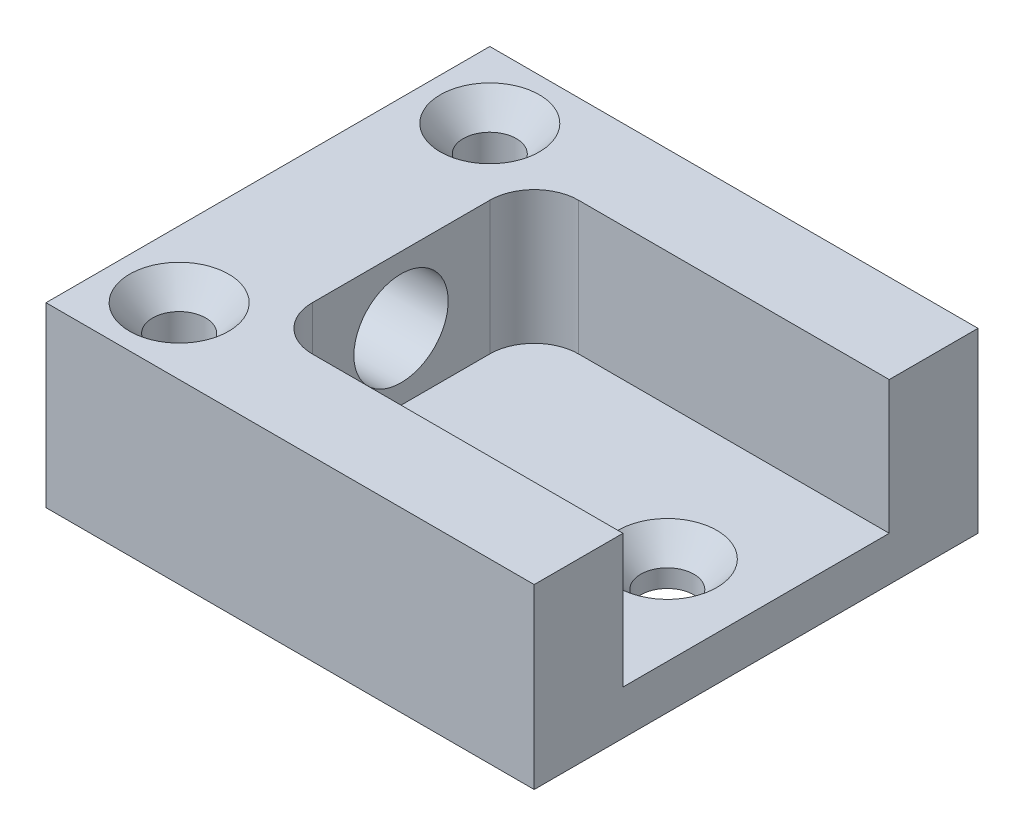
ISO-10303-21;
HEADER;
FILE_DESCRIPTION(('STEP AP214'),'2;1');
FILE_NAME('part.step','',(''),(''),'','','');
FILE_SCHEMA(('AUTOMOTIVE_DESIGN { 1 0 10303 214 1 1 1 1 }'));
ENDSEC;
DATA;
#1=APPLICATION_CONTEXT('core data for automotive mechanical design processes');
#2=APPLICATION_PROTOCOL_DEFINITION('international standard','automotive_design',2000,#1);
#3=PRODUCT_CONTEXT('',#1,'mechanical');
#4=PRODUCT('Part','Part','',(#3));
#5=PRODUCT_RELATED_PRODUCT_CATEGORY('part','',(#4));
#6=PRODUCT_DEFINITION_FORMATION('','',#4);
#7=PRODUCT_DEFINITION_CONTEXT('part definition',#1,'design');
#8=PRODUCT_DEFINITION('design','',#6,#7);
#9=PRODUCT_DEFINITION_SHAPE('','',#8);
#10=(LENGTH_UNIT() NAMED_UNIT(*) SI_UNIT(.MILLI.,.METRE.));
#11=(NAMED_UNIT(*) PLANE_ANGLE_UNIT() SI_UNIT($,.RADIAN.));
#12=(NAMED_UNIT(*) SI_UNIT($,.STERADIAN.) SOLID_ANGLE_UNIT());
#13=UNCERTAINTY_MEASURE_WITH_UNIT(LENGTH_MEASURE(1.E-05),#10,'distance_accuracy_value','');
#14=(GEOMETRIC_REPRESENTATION_CONTEXT(3) GLOBAL_UNCERTAINTY_ASSIGNED_CONTEXT((#13)) GLOBAL_UNIT_ASSIGNED_CONTEXT((#10,
#11,#12)) REPRESENTATION_CONTEXT('',''));
#15=CARTESIAN_POINT('',(0.,0.,0.));
#16=DIRECTION('',(0.,0.,1.));
#17=DIRECTION('',(1.,0.,0.));
#18=AXIS2_PLACEMENT_3D('',#15,#16,#17);
#19=CARTESIAN_POINT('',(34.925,12.7,9.525));
#20=DIRECTION('',(0.,0.,1.));
#21=DIRECTION('',(1.,0.,0.));
#22=AXIS2_PLACEMENT_3D('',#19,#20,#21);
#23=PLANE('',#22);
#24=DIRECTION('',(-1.,0.,0.));
#25=VECTOR('',#24,1.);
#26=CARTESIAN_POINT('',(9.525,3.175,9.525));
#27=LINE('',#26,#25);
#28=CARTESIAN_POINT('',(34.925,3.175,9.525));
#29=VERTEX_POINT('',#28);
#30=CARTESIAN_POINT('',(12.7,3.175,9.525));
#31=VERTEX_POINT('',#30);
#32=EDGE_CURVE('E192',#29,#31,#27,.T.);
#33=ORIENTED_EDGE('',*,*,#32,.T.);
#34=DIRECTION('',(0.,-1.,0.));
#35=VECTOR('',#34,1.);
#36=CARTESIAN_POINT('',(12.7,12.7,9.525));
#37=LINE('',#36,#35);
#38=CARTESIAN_POINT('',(12.7,12.7,9.525));
#39=VERTEX_POINT('',#38);
#40=EDGE_CURVE('E56',#31,#39,#37,.F.);
#41=ORIENTED_EDGE('',*,*,#40,.T.);
#42=DIRECTION('',(-1.,0.,0.));
#43=VECTOR('',#42,1.);
#44=CARTESIAN_POINT('',(34.925,12.7,9.525));
#45=LINE('',#44,#43);
#46=CARTESIAN_POINT('',(34.925,12.7,9.525));
#47=VERTEX_POINT('',#46);
#48=EDGE_CURVE('E197',#47,#39,#45,.T.);
#49=ORIENTED_EDGE('',*,*,#48,.F.);
#50=DIRECTION('',(0.,-1.,0.));
#51=VECTOR('',#50,1.);
#52=CARTESIAN_POINT('',(34.925,12.7,9.525));
#53=LINE('',#52,#51);
#54=EDGE_CURVE('E216',#47,#29,#53,.T.);
#55=ORIENTED_EDGE('',*,*,#54,.T.);
#56=EDGE_LOOP('',(#33,#41,#49,#55));
#57=FACE_BOUND('',#56,.T.);
#58=ADVANCED_FACE('F33',(#57),#23,.F.);
#59=CARTESIAN_POINT('',(9.525,12.7,9.525));
#60=DIRECTION('',(-1.,0.,0.));
#61=DIRECTION('',(0.,0.,1.));
#62=AXIS2_PLACEMENT_3D('',#59,#60,#61);
#63=PLANE('',#62);
#64=CARTESIAN_POINT('',(9.525,7.9375,0.));
#65=DIRECTION('',(-1.,0.,0.));
#66=DIRECTION('',(0.,0.,1.));
#67=AXIS2_PLACEMENT_3D('',#64,#65,#66);
#68=CIRCLE('',#67,3.373501);
#69=CARTESIAN_POINT('',(9.525,7.9375,3.373501));
#70=VERTEX_POINT('',#69);
#71=EDGE_CURVE('E181',#70,#70,#68,.T.);
#72=ORIENTED_EDGE('',*,*,#71,.T.);
#73=EDGE_LOOP('',(#72));
#74=FACE_BOUND('',#73,.T.);
#75=DIRECTION('',(0.,0.,-1.));
#76=VECTOR('',#75,1.);
#77=CARTESIAN_POINT('',(9.525,12.7,9.525));
#78=LINE('',#77,#76);
#79=CARTESIAN_POINT('',(9.525,12.7,6.35));
#80=VERTEX_POINT('',#79);
#81=CARTESIAN_POINT('',(9.525,12.7,-6.34999999999999));
#82=VERTEX_POINT('',#81);
#83=EDGE_CURVE('E199',#80,#82,#78,.T.);
#84=ORIENTED_EDGE('',*,*,#83,.F.);
#85=DIRECTION('',(0.,-1.,0.));
#86=VECTOR('',#85,1.);
#87=CARTESIAN_POINT('',(9.525,3.175,6.35));
#88=LINE('',#87,#86);
#89=CARTESIAN_POINT('',(9.525,3.175,6.35));
#90=VERTEX_POINT('',#89);
#91=EDGE_CURVE('E139',#80,#90,#88,.T.);
#92=ORIENTED_EDGE('',*,*,#91,.T.);
#93=DIRECTION('',(0.,0.,-1.));
#94=VECTOR('',#93,1.);
#95=CARTESIAN_POINT('',(9.525,3.175,9.525));
#96=LINE('',#95,#94);
#97=CARTESIAN_POINT('',(9.525,3.175,-6.34999999999999));
#98=VERTEX_POINT('',#97);
#99=EDGE_CURVE('E184',#90,#98,#96,.T.);
#100=ORIENTED_EDGE('',*,*,#99,.T.);
#101=DIRECTION('',(0.,-1.,0.));
#102=VECTOR('',#101,1.);
#103=CARTESIAN_POINT('',(9.525,12.7,-6.35));
#104=LINE('',#103,#102);
#105=EDGE_CURVE('E137',#98,#82,#104,.F.);
#106=ORIENTED_EDGE('',*,*,#105,.T.);
#107=EDGE_LOOP('',(#84,#92,#100,#106));
#108=FACE_BOUND('',#107,.T.);
#109=ADVANCED_FACE('F245',(#74,#108),#63,.F.);
#110=CARTESIAN_POINT('',(9.525,12.7,-9.525));
#111=DIRECTION('',(0.,0.,-1.));
#112=DIRECTION('',(-1.,0.,0.));
#113=AXIS2_PLACEMENT_3D('',#110,#111,#112);
#114=PLANE('',#113);
#115=DIRECTION('',(1.,0.,0.));
#116=VECTOR('',#115,1.);
#117=CARTESIAN_POINT('',(9.525,12.7,-9.525));
#118=LINE('',#117,#116);
#119=CARTESIAN_POINT('',(12.7,12.7,-9.525));
#120=VERTEX_POINT('',#119);
#121=CARTESIAN_POINT('',(34.925,12.7,-9.525));
#122=VERTEX_POINT('',#121);
#123=EDGE_CURVE('E201',#120,#122,#118,.T.);
#124=ORIENTED_EDGE('',*,*,#123,.F.);
#125=DIRECTION('',(0.,-1.,0.));
#126=VECTOR('',#125,1.);
#127=CARTESIAN_POINT('',(12.7,3.175,-9.525));
#128=LINE('',#127,#126);
#129=CARTESIAN_POINT('',(12.7,3.175,-9.525));
#130=VERTEX_POINT('',#129);
#131=EDGE_CURVE('E152',#120,#130,#128,.T.);
#132=ORIENTED_EDGE('',*,*,#131,.T.);
#133=DIRECTION('',(1.,0.,0.));
#134=VECTOR('',#133,1.);
#135=CARTESIAN_POINT('',(9.525,3.175,-9.525));
#136=LINE('',#135,#134);
#137=CARTESIAN_POINT('',(34.925,3.175,-9.525));
#138=VERTEX_POINT('',#137);
#139=EDGE_CURVE('E187',#130,#138,#136,.T.);
#140=ORIENTED_EDGE('',*,*,#139,.T.);
#141=DIRECTION('',(0.,-1.,0.));
#142=VECTOR('',#141,1.);
#143=CARTESIAN_POINT('',(34.925,12.7,-9.525));
#144=LINE('',#143,#142);
#145=EDGE_CURVE('E213',#122,#138,#144,.T.);
#146=ORIENTED_EDGE('',*,*,#145,.F.);
#147=EDGE_LOOP('',(#124,#132,#140,#146));
#148=FACE_BOUND('',#147,.T.);
#149=ADVANCED_FACE('F250',(#148),#114,.F.);
#150=CARTESIAN_POINT('',(34.925,12.7,-15.875));
#151=DIRECTION('',(0.,0.,1.));
#152=DIRECTION('',(1.,0.,0.));
#153=AXIS2_PLACEMENT_3D('',#150,#151,#152);
#154=PLANE('',#153);
#155=DIRECTION('',(-1.,0.,0.));
#156=VECTOR('',#155,1.);
#157=CARTESIAN_POINT('',(34.925,0.,-15.875));
#158=LINE('',#157,#156);
#159=CARTESIAN_POINT('',(34.925,0.,-15.875));
#160=VERTEX_POINT('',#159);
#161=CARTESIAN_POINT('',(0.,0.,-15.875));
#162=VERTEX_POINT('',#161);
#163=EDGE_CURVE('E136',#160,#162,#158,.T.);
#164=ORIENTED_EDGE('',*,*,#163,.T.);
#165=DIRECTION('',(0.,-1.,0.));
#166=VECTOR('',#165,1.);
#167=CARTESIAN_POINT('',(0.,12.7,-15.875));
#168=LINE('',#167,#166);
#169=CARTESIAN_POINT('',(0.,12.7,-15.875));
#170=VERTEX_POINT('',#169);
#171=EDGE_CURVE('E117',#170,#162,#168,.T.);
#172=ORIENTED_EDGE('',*,*,#171,.F.);
#173=DIRECTION('',(-1.,0.,0.));
#174=VECTOR('',#173,1.);
#175=CARTESIAN_POINT('',(34.925,12.7,-15.875));
#176=LINE('',#175,#174);
#177=CARTESIAN_POINT('',(34.925,12.7,-15.875));
#178=VERTEX_POINT('',#177);
#179=EDGE_CURVE('E123',#178,#170,#176,.T.);
#180=ORIENTED_EDGE('',*,*,#179,.F.);
#181=DIRECTION('',(0.,-1.,0.));
#182=VECTOR('',#181,1.);
#183=CARTESIAN_POINT('',(34.925,12.7,-15.875));
#184=LINE('',#183,#182);
#185=EDGE_CURVE('E204',#178,#160,#184,.T.);
#186=ORIENTED_EDGE('',*,*,#185,.T.);
#187=EDGE_LOOP('',(#164,#172,#180,#186));
#188=FACE_BOUND('',#187,.T.);
#189=ADVANCED_FACE('F134',(#188),#154,.F.);
#190=CARTESIAN_POINT('',(0.,12.7,-15.875));
#191=DIRECTION('',(1.,0.,0.));
#192=DIRECTION('',(0.,0.,-1.));
#193=AXIS2_PLACEMENT_3D('',#190,#191,#192);
#194=PLANE('',#193);
#195=CARTESIAN_POINT('',(0.,7.9375,0.));
#196=DIRECTION('',(-1.,0.,0.));
#197=DIRECTION('',(0.,0.,1.));
#198=AXIS2_PLACEMENT_3D('',#195,#196,#197);
#199=CIRCLE('',#198,3.373501);
#200=CARTESIAN_POINT('',(0.,7.9375,3.373501));
#201=VERTEX_POINT('',#200);
#202=EDGE_CURVE('E158',#201,#201,#199,.T.);
#203=ORIENTED_EDGE('',*,*,#202,.F.);
#204=EDGE_LOOP('',(#203));
#205=FACE_BOUND('',#204,.T.);
#206=DIRECTION('',(0.,0.,1.));
#207=VECTOR('',#206,1.);
#208=CARTESIAN_POINT('',(0.,0.,-15.875));
#209=LINE('',#208,#207);
#210=CARTESIAN_POINT('',(0.,0.,15.875));
#211=VERTEX_POINT('',#210);
#212=EDGE_CURVE('E206',#162,#211,#209,.T.);
#213=ORIENTED_EDGE('',*,*,#212,.T.);
#214=DIRECTION('',(0.,-1.,0.));
#215=VECTOR('',#214,1.);
#216=CARTESIAN_POINT('',(0.,12.7,15.875));
#217=LINE('',#216,#215);
#218=CARTESIAN_POINT('',(0.,12.7,15.875));
#219=VERTEX_POINT('',#218);
#220=EDGE_CURVE('E120',#219,#211,#217,.T.);
#221=ORIENTED_EDGE('',*,*,#220,.F.);
#222=DIRECTION('',(0.,0.,1.));
#223=VECTOR('',#222,1.);
#224=CARTESIAN_POINT('',(0.,12.7,-15.875));
#225=LINE('',#224,#223);
#226=EDGE_CURVE('E113',#170,#219,#225,.T.);
#227=ORIENTED_EDGE('',*,*,#226,.F.);
#228=ORIENTED_EDGE('',*,*,#171,.T.);
#229=EDGE_LOOP('',(#213,#221,#227,#228));
#230=FACE_BOUND('',#229,.T.);
#231=ADVANCED_FACE('F115',(#205,#230),#194,.F.);
#232=CARTESIAN_POINT('',(0.,12.7,15.875));
#233=DIRECTION('',(0.,0.,-1.));
#234=DIRECTION('',(-1.,0.,0.));
#235=AXIS2_PLACEMENT_3D('',#232,#233,#234);
#236=PLANE('',#235);
#237=DIRECTION('',(1.,0.,0.));
#238=VECTOR('',#237,1.);
#239=CARTESIAN_POINT('',(0.,0.,15.875));
#240=LINE('',#239,#238);
#241=CARTESIAN_POINT('',(34.925,0.,15.875));
#242=VERTEX_POINT('',#241);
#243=EDGE_CURVE('E208',#211,#242,#240,.T.);
#244=ORIENTED_EDGE('',*,*,#243,.T.);
#245=DIRECTION('',(0.,-1.,0.));
#246=VECTOR('',#245,1.);
#247=CARTESIAN_POINT('',(34.925,12.7,15.875));
#248=LINE('',#247,#246);
#249=CARTESIAN_POINT('',(34.925,12.7,15.875));
#250=VERTEX_POINT('',#249);
#251=EDGE_CURVE('E141',#250,#242,#248,.T.);
#252=ORIENTED_EDGE('',*,*,#251,.F.);
#253=DIRECTION('',(1.,0.,0.));
#254=VECTOR('',#253,1.);
#255=CARTESIAN_POINT('',(0.,12.7,15.875));
#256=LINE('',#255,#254);
#257=EDGE_CURVE('E122',#219,#250,#256,.T.);
#258=ORIENTED_EDGE('',*,*,#257,.F.);
#259=ORIENTED_EDGE('',*,*,#220,.T.);
#260=EDGE_LOOP('',(#244,#252,#258,#259));
#261=FACE_BOUND('',#260,.T.);
#262=ADVANCED_FACE('F224',(#261),#236,.F.);
#263=CARTESIAN_POINT('',(34.925,12.7,-9.525));
#264=DIRECTION('',(-1.,0.,0.));
#265=DIRECTION('',(0.,0.,1.));
#266=AXIS2_PLACEMENT_3D('',#263,#264,#265);
#267=PLANE('',#266);
#268=DIRECTION('',(0.,0.,-1.));
#269=VECTOR('',#268,1.);
#270=CARTESIAN_POINT('',(34.925,0.,-9.525));
#271=LINE('',#270,#269);
#272=EDGE_CURVE('E132',#242,#160,#271,.T.);
#273=ORIENTED_EDGE('',*,*,#272,.T.);
#274=ORIENTED_EDGE('',*,*,#185,.F.);
#275=DIRECTION('',(0.,0.,-1.));
#276=VECTOR('',#275,1.);
#277=CARTESIAN_POINT('',(34.925,12.7,-9.525));
#278=LINE('',#277,#276);
#279=EDGE_CURVE('E128',#122,#178,#278,.T.);
#280=ORIENTED_EDGE('',*,*,#279,.F.);
#281=ORIENTED_EDGE('',*,*,#145,.T.);
#282=DIRECTION('',(0.,0.,1.));
#283=VECTOR('',#282,1.);
#284=CARTESIAN_POINT('',(34.925,3.175,9.525));
#285=LINE('',#284,#283);
#286=EDGE_CURVE('E189',#138,#29,#285,.T.);
#287=ORIENTED_EDGE('',*,*,#286,.T.);
#288=ORIENTED_EDGE('',*,*,#54,.F.);
#289=DIRECTION('',(0.,0.,-1.));
#290=VECTOR('',#289,1.);
#291=CARTESIAN_POINT('',(34.925,12.7,15.875));
#292=LINE('',#291,#290);
#293=EDGE_CURVE('E195',#250,#47,#292,.T.);
#294=ORIENTED_EDGE('',*,*,#293,.F.);
#295=ORIENTED_EDGE('',*,*,#251,.T.);
#296=EDGE_LOOP('',(#273,#274,#280,#281,#287,#288,#294,#295));
#297=FACE_BOUND('',#296,.T.);
#298=ADVANCED_FACE('F221',(#297),#267,.F.);
#299=CARTESIAN_POINT('',(0.,12.7,0.));
#300=DIRECTION('',(0.,1.,0.));
#301=DIRECTION('',(0.,0.,1.));
#302=AXIS2_PLACEMENT_3D('',#299,#300,#301);
#303=PLANE('',#302);
#304=CARTESIAN_POINT('',(4.76250000000001,12.7,11.1125));
#305=DIRECTION('',(0.,1.,0.));
#306=DIRECTION('',(0.,0.,1.));
#307=AXIS2_PLACEMENT_3D('',#304,#305,#306);
#308=CIRCLE('',#307,3.5433);
#309=CARTESIAN_POINT('',(4.76250000000001,12.7,14.6558));
#310=VERTEX_POINT('',#309);
#311=EDGE_CURVE('E169',#310,#310,#308,.T.);
#312=ORIENTED_EDGE('',*,*,#311,.F.);
#313=EDGE_LOOP('',(#312));
#314=FACE_BOUND('',#313,.T.);
#315=CARTESIAN_POINT('',(4.7625,12.7,-11.1125));
#316=DIRECTION('',(0.,1.,0.));
#317=DIRECTION('',(0.,0.,1.));
#318=AXIS2_PLACEMENT_3D('',#315,#316,#317);
#319=CIRCLE('',#318,3.5433);
#320=CARTESIAN_POINT('',(4.7625,12.7,-7.5692));
#321=VERTEX_POINT('',#320);
#322=EDGE_CURVE('E162',#321,#321,#319,.T.);
#323=ORIENTED_EDGE('',*,*,#322,.F.);
#324=EDGE_LOOP('',(#323));
#325=FACE_BOUND('',#324,.T.);
#326=ORIENTED_EDGE('',*,*,#179,.T.);
#327=ORIENTED_EDGE('',*,*,#226,.T.);
#328=ORIENTED_EDGE('',*,*,#257,.T.);
#329=ORIENTED_EDGE('',*,*,#293,.T.);
#330=ORIENTED_EDGE('',*,*,#48,.T.);
#331=CARTESIAN_POINT('',(12.7,12.7,6.35));
#332=DIRECTION('',(0.,1.,0.));
#333=DIRECTION('',(0.,0.,1.));
#334=AXIS2_PLACEMENT_3D('',#331,#332,#333);
#335=CIRCLE('',#334,3.175);
#336=EDGE_CURVE('E42',#39,#80,#335,.F.);
#337=ORIENTED_EDGE('',*,*,#336,.T.);
#338=ORIENTED_EDGE('',*,*,#83,.T.);
#339=CARTESIAN_POINT('',(12.7,12.7,-6.35));
#340=DIRECTION('',(0.,1.,0.));
#341=DIRECTION('',(0.,0.,1.));
#342=AXIS2_PLACEMENT_3D('',#339,#340,#341);
#343=CIRCLE('',#342,3.175);
#344=EDGE_CURVE('E11',#82,#120,#343,.F.);
#345=ORIENTED_EDGE('',*,*,#344,.T.);
#346=ORIENTED_EDGE('',*,*,#123,.T.);
#347=ORIENTED_EDGE('',*,*,#279,.T.);
#348=EDGE_LOOP('',(#326,#327,#328,#329,#330,#337,#338,#345,#346,#347));
#349=FACE_BOUND('',#348,.T.);
#350=ADVANCED_FACE('F126',(#314,#325,#349),#303,.T.);
#351=CARTESIAN_POINT('',(0.,0.,0.));
#352=DIRECTION('',(0.,1.,0.));
#353=DIRECTION('',(0.,0.,1.));
#354=AXIS2_PLACEMENT_3D('',#351,#352,#353);
#355=PLANE('',#354);
#356=CARTESIAN_POINT('',(28.575,0.,0.));
#357=DIRECTION('',(0.,1.,0.));
#358=DIRECTION('',(0.,0.,1.));
#359=AXIS2_PLACEMENT_3D('',#356,#357,#358);
#360=CIRCLE('',#359,1.89864999999999);
#361=CARTESIAN_POINT('',(28.575,0.,1.89864999999999));
#362=VERTEX_POINT('',#361);
#363=EDGE_CURVE('E37',#362,#362,#360,.T.);
#364=ORIENTED_EDGE('',*,*,#363,.T.);
#365=EDGE_LOOP('',(#364));
#366=FACE_BOUND('',#365,.T.);
#367=CARTESIAN_POINT('',(4.76250000000001,0.,11.1125));
#368=DIRECTION('',(0.,1.,0.));
#369=DIRECTION('',(0.,0.,1.));
#370=AXIS2_PLACEMENT_3D('',#367,#368,#369);
#371=CIRCLE('',#370,1.89865);
#372=CARTESIAN_POINT('',(4.76250000000001,0.,13.01115));
#373=VERTEX_POINT('',#372);
#374=EDGE_CURVE('E160',#373,#373,#371,.T.);
#375=ORIENTED_EDGE('',*,*,#374,.T.);
#376=EDGE_LOOP('',(#375));
#377=FACE_BOUND('',#376,.T.);
#378=CARTESIAN_POINT('',(4.7625,0.,-11.1125));
#379=DIRECTION('',(0.,1.,0.));
#380=DIRECTION('',(0.,0.,1.));
#381=AXIS2_PLACEMENT_3D('',#378,#379,#380);
#382=CIRCLE('',#381,1.89865);
#383=CARTESIAN_POINT('',(4.7625,0.,-9.21385));
#384=VERTEX_POINT('',#383);
#385=EDGE_CURVE('E156',#384,#384,#382,.T.);
#386=ORIENTED_EDGE('',*,*,#385,.T.);
#387=EDGE_LOOP('',(#386));
#388=FACE_BOUND('',#387,.T.);
#389=ORIENTED_EDGE('',*,*,#163,.F.);
#390=ORIENTED_EDGE('',*,*,#272,.F.);
#391=ORIENTED_EDGE('',*,*,#243,.F.);
#392=ORIENTED_EDGE('',*,*,#212,.F.);
#393=EDGE_LOOP('',(#389,#390,#391,#392));
#394=FACE_BOUND('',#393,.T.);
#395=ADVANCED_FACE('F227',(#366,#377,#388,#394),#355,.F.);
#396=CARTESIAN_POINT('',(0.,3.175,0.));
#397=DIRECTION('',(0.,-1.,0.));
#398=DIRECTION('',(0.,0.,-1.));
#399=AXIS2_PLACEMENT_3D('',#396,#397,#398);
#400=PLANE('',#399);
#401=CARTESIAN_POINT('',(28.575,3.175,0.));
#402=DIRECTION('',(0.,1.,0.));
#403=DIRECTION('',(0.,0.,1.));
#404=AXIS2_PLACEMENT_3D('',#401,#402,#403);
#405=CIRCLE('',#404,3.5433);
#406=CARTESIAN_POINT('',(28.575,3.175,3.5433));
#407=VERTEX_POINT('',#406);
#408=EDGE_CURVE('E444',#407,#407,#405,.T.);
#409=ORIENTED_EDGE('',*,*,#408,.F.);
#410=EDGE_LOOP('',(#409));
#411=FACE_BOUND('',#410,.T.);
#412=ORIENTED_EDGE('',*,*,#99,.F.);
#413=CARTESIAN_POINT('',(12.7,3.175,6.35));
#414=DIRECTION('',(0.,-1.,0.));
#415=DIRECTION('',(0.,0.,-1.));
#416=AXIS2_PLACEMENT_3D('',#413,#414,#415);
#417=CIRCLE('',#416,3.175);
#418=EDGE_CURVE('E149',#90,#31,#417,.F.);
#419=ORIENTED_EDGE('',*,*,#418,.T.);
#420=ORIENTED_EDGE('',*,*,#32,.F.);
#421=ORIENTED_EDGE('',*,*,#286,.F.);
#422=ORIENTED_EDGE('',*,*,#139,.F.);
#423=CARTESIAN_POINT('',(12.7,3.175,-6.35));
#424=DIRECTION('',(0.,-1.,0.));
#425=DIRECTION('',(0.,0.,-1.));
#426=AXIS2_PLACEMENT_3D('',#423,#424,#425);
#427=CIRCLE('',#426,3.175);
#428=EDGE_CURVE('E147',#130,#98,#427,.F.);
#429=ORIENTED_EDGE('',*,*,#428,.T.);
#430=EDGE_LOOP('',(#412,#419,#420,#421,#422,#429));
#431=FACE_BOUND('',#430,.T.);
#432=ADVANCED_FACE('F229',(#411,#431),#400,.F.);
#433=CARTESIAN_POINT('',(12.7,12.7,6.35));
#434=DIRECTION('',(0.,1.,0.));
#435=DIRECTION('',(0.,0.,1.));
#436=AXIS2_PLACEMENT_3D('',#433,#434,#435);
#437=CYLINDRICAL_SURFACE('',#436,3.175);
#438=ORIENTED_EDGE('',*,*,#336,.F.);
#439=ORIENTED_EDGE('',*,*,#40,.F.);
#440=ORIENTED_EDGE('',*,*,#418,.F.);
#441=ORIENTED_EDGE('',*,*,#91,.F.);
#442=EDGE_LOOP('',(#438,#439,#440,#441));
#443=FACE_BOUND('',#442,.T.);
#444=ADVANCED_FACE('F236',(#443),#437,.F.);
#445=CARTESIAN_POINT('',(12.7,12.7,-6.35));
#446=DIRECTION('',(0.,1.,0.));
#447=DIRECTION('',(0.,0.,1.));
#448=AXIS2_PLACEMENT_3D('',#445,#446,#447);
#449=CYLINDRICAL_SURFACE('',#448,3.175);
#450=ORIENTED_EDGE('',*,*,#344,.F.);
#451=ORIENTED_EDGE('',*,*,#105,.F.);
#452=ORIENTED_EDGE('',*,*,#428,.F.);
#453=ORIENTED_EDGE('',*,*,#131,.F.);
#454=EDGE_LOOP('',(#450,#451,#452,#453));
#455=FACE_BOUND('',#454,.T.);
#456=ADVANCED_FACE('F35',(#455),#449,.F.);
#457=CARTESIAN_POINT('',(0.,7.9375,0.));
#458=DIRECTION('',(-1.,0.,0.));
#459=DIRECTION('',(0.,0.,1.));
#460=AXIS2_PLACEMENT_3D('',#457,#458,#459);
#461=CYLINDRICAL_SURFACE('',#460,3.373501);
#462=ORIENTED_EDGE('',*,*,#202,.T.);
#463=EDGE_LOOP('',(#462));
#464=FACE_BOUND('',#463,.T.);
#465=ORIENTED_EDGE('',*,*,#71,.F.);
#466=EDGE_LOOP('',(#465));
#467=FACE_BOUND('',#466,.T.);
#468=ADVANCED_FACE('F267',(#464,#467),#461,.F.);
#469=CARTESIAN_POINT('',(4.7625,12.7,-11.1125));
#470=DIRECTION('',(0.,1.,0.));
#471=DIRECTION('',(0.,0.,1.));
#472=AXIS2_PLACEMENT_3D('',#469,#470,#471);
#473=CYLINDRICAL_SURFACE('',#472,1.89865);
#474=CARTESIAN_POINT('',(4.7625,10.808046599064,-11.1125));
#475=DIRECTION('',(0.,1.,0.));
#476=DIRECTION('',(0.,0.,1.));
#477=AXIS2_PLACEMENT_3D('',#474,#475,#476);
#478=CIRCLE('',#477,1.89865);
#479=CARTESIAN_POINT('',(4.7625,10.808046599064,-9.21385));
#480=VERTEX_POINT('',#479);
#481=EDGE_CURVE('E159',#480,#480,#478,.T.);
#482=ORIENTED_EDGE('',*,*,#481,.T.);
#483=EDGE_LOOP('',(#482));
#484=FACE_BOUND('',#483,.T.);
#485=ORIENTED_EDGE('',*,*,#385,.F.);
#486=EDGE_LOOP('',(#485));
#487=FACE_BOUND('',#486,.T.);
#488=ADVANCED_FACE('F346',(#484,#487),#473,.F.);
#489=CARTESIAN_POINT('',(4.7625,12.7,-11.1125));
#490=DIRECTION('',(0.,1.,0.));
#491=DIRECTION('',(0.,0.,1.));
#492=AXIS2_PLACEMENT_3D('',#489,#490,#491);
#493=CONICAL_SURFACE('',#492,3.5433,0.715584993317674);
#494=ORIENTED_EDGE('',*,*,#481,.F.);
#495=EDGE_LOOP('',(#494));
#496=FACE_BOUND('',#495,.T.);
#497=ORIENTED_EDGE('',*,*,#322,.T.);
#498=EDGE_LOOP('',(#497));
#499=FACE_BOUND('',#498,.T.);
#500=ADVANCED_FACE('F343',(#496,#499),#493,.F.);
#501=CARTESIAN_POINT('',(4.76250000000001,12.7,11.1125));
#502=DIRECTION('',(0.,1.,0.));
#503=DIRECTION('',(0.,0.,1.));
#504=AXIS2_PLACEMENT_3D('',#501,#502,#503);
#505=CYLINDRICAL_SURFACE('',#504,1.89865);
#506=CARTESIAN_POINT('',(4.76250000000001,10.808046599064,11.1125));
#507=DIRECTION('',(0.,1.,0.));
#508=DIRECTION('',(0.,0.,1.));
#509=AXIS2_PLACEMENT_3D('',#506,#507,#508);
#510=CIRCLE('',#509,1.89865);
#511=CARTESIAN_POINT('',(4.76250000000001,10.808046599064,13.01115));
#512=VERTEX_POINT('',#511);
#513=EDGE_CURVE('E163',#512,#512,#510,.T.);
#514=ORIENTED_EDGE('',*,*,#513,.T.);
#515=EDGE_LOOP('',(#514));
#516=FACE_BOUND('',#515,.T.);
#517=ORIENTED_EDGE('',*,*,#374,.F.);
#518=EDGE_LOOP('',(#517));
#519=FACE_BOUND('',#518,.T.);
#520=ADVANCED_FACE('F339',(#516,#519),#505,.F.);
#521=CARTESIAN_POINT('',(4.76250000000001,12.7,11.1125));
#522=DIRECTION('',(0.,1.,0.));
#523=DIRECTION('',(0.,0.,1.));
#524=AXIS2_PLACEMENT_3D('',#521,#522,#523);
#525=CONICAL_SURFACE('',#524,3.5433,0.715584993317675);
#526=ORIENTED_EDGE('',*,*,#513,.F.);
#527=EDGE_LOOP('',(#526));
#528=FACE_BOUND('',#527,.T.);
#529=ORIENTED_EDGE('',*,*,#311,.T.);
#530=EDGE_LOOP('',(#529));
#531=FACE_BOUND('',#530,.T.);
#532=ADVANCED_FACE('F319',(#528,#531),#525,.F.);
#533=CARTESIAN_POINT('',(28.575,3.175,0.));
#534=DIRECTION('',(0.,1.,0.));
#535=DIRECTION('',(0.,0.,1.));
#536=AXIS2_PLACEMENT_3D('',#533,#534,#535);
#537=CYLINDRICAL_SURFACE('',#536,1.89864999999999);
#538=CARTESIAN_POINT('',(28.575,1.28304659906394,0.));
#539=DIRECTION('',(0.,1.,0.));
#540=DIRECTION('',(0.,0.,1.));
#541=AXIS2_PLACEMENT_3D('',#538,#539,#540);
#542=CIRCLE('',#541,1.89864999999999);
#543=CARTESIAN_POINT('',(28.575,1.28304659906394,1.89864999999999));
#544=VERTEX_POINT('',#543);
#545=EDGE_CURVE('E441',#544,#544,#542,.T.);
#546=ORIENTED_EDGE('',*,*,#545,.T.);
#547=EDGE_LOOP('',(#546));
#548=FACE_BOUND('',#547,.T.);
#549=ORIENTED_EDGE('',*,*,#363,.F.);
#550=EDGE_LOOP('',(#549));
#551=FACE_BOUND('',#550,.T.);
#552=ADVANCED_FACE('F313',(#548,#551),#537,.F.);
#553=CARTESIAN_POINT('',(28.575,3.175,0.));
#554=DIRECTION('',(0.,1.,0.));
#555=DIRECTION('',(0.,0.,1.));
#556=AXIS2_PLACEMENT_3D('',#553,#554,#555);
#557=CONICAL_SURFACE('',#556,3.5433,0.71558499331767);
#558=ORIENTED_EDGE('',*,*,#545,.F.);
#559=EDGE_LOOP('',(#558));
#560=FACE_BOUND('',#559,.T.);
#561=ORIENTED_EDGE('',*,*,#408,.T.);
#562=EDGE_LOOP('',(#561));
#563=FACE_BOUND('',#562,.T.);
#564=ADVANCED_FACE('F318',(#560,#563),#557,.F.);
#565=CLOSED_SHELL('',(#58,#109,#149,#189,#231,#262,#298,#350,#395,#432,#444,#456,#468,#488,#500,
#520,#532,#552,#564));
#566=MANIFOLD_SOLID_BREP('B2',#565);
#567=ADVANCED_BREP_SHAPE_REPRESENTATION('',(#18,#566),#14);
#568=SHAPE_DEFINITION_REPRESENTATION(#9,#567);
ENDSEC;
END-ISO-10303-21;
